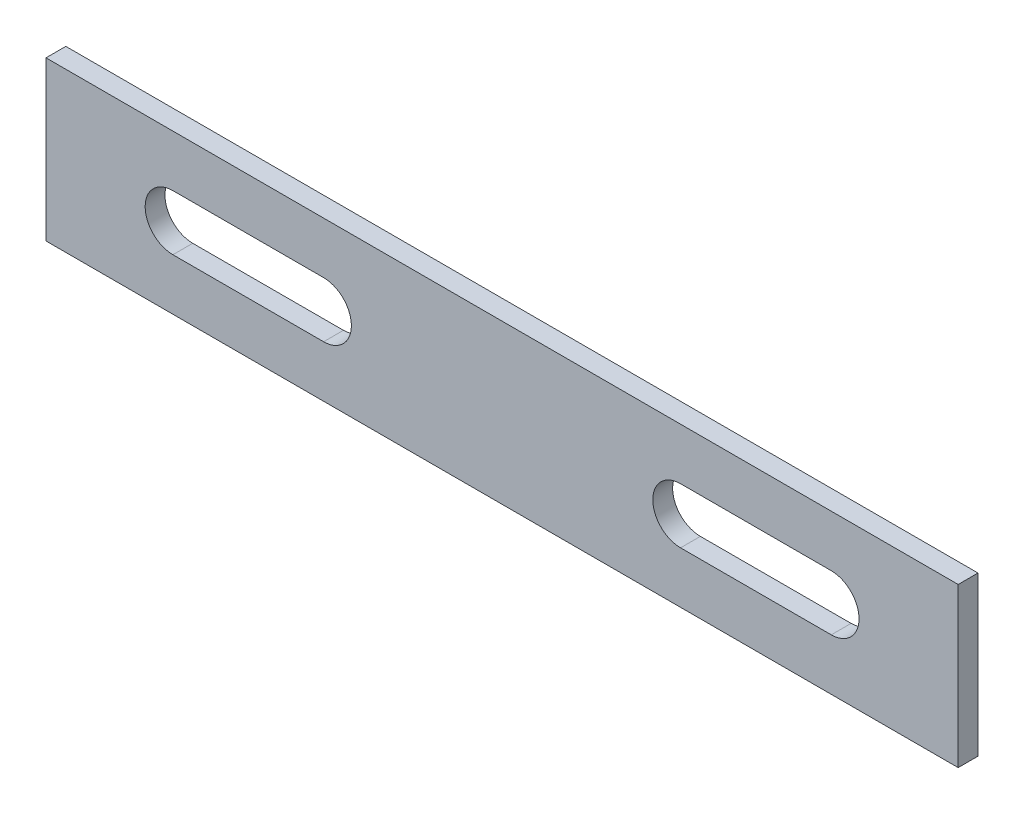
ISO-10303-21;
HEADER;
FILE_DESCRIPTION(('STEP AP214'),'2;1');
FILE_NAME('part.step','',(''),(''),'','','');
FILE_SCHEMA(('AUTOMOTIVE_DESIGN { 1 0 10303 214 1 1 1 1 }'));
ENDSEC;
DATA;
#1=APPLICATION_CONTEXT('core data for automotive mechanical design processes');
#2=APPLICATION_PROTOCOL_DEFINITION('international standard','automotive_design',2000,#1);
#3=PRODUCT_CONTEXT('',#1,'mechanical');
#4=PRODUCT('Part','Part','',(#3));
#5=PRODUCT_RELATED_PRODUCT_CATEGORY('part','',(#4));
#6=PRODUCT_DEFINITION_FORMATION('','',#4);
#7=PRODUCT_DEFINITION_CONTEXT('part definition',#1,'design');
#8=PRODUCT_DEFINITION('design','',#6,#7);
#9=PRODUCT_DEFINITION_SHAPE('','',#8);
#10=(LENGTH_UNIT() NAMED_UNIT(*) SI_UNIT(.MILLI.,.METRE.));
#11=(NAMED_UNIT(*) PLANE_ANGLE_UNIT() SI_UNIT($,.RADIAN.));
#12=(NAMED_UNIT(*) SI_UNIT($,.STERADIAN.) SOLID_ANGLE_UNIT());
#13=UNCERTAINTY_MEASURE_WITH_UNIT(LENGTH_MEASURE(1.E-05),#10,'distance_accuracy_value','');
#14=(GEOMETRIC_REPRESENTATION_CONTEXT(3) GLOBAL_UNCERTAINTY_ASSIGNED_CONTEXT((#13)) GLOBAL_UNIT_ASSIGNED_CONTEXT((#10,
#11,#12)) REPRESENTATION_CONTEXT('',''));
#15=CARTESIAN_POINT('',(0.,0.,0.));
#16=DIRECTION('',(0.,0.,1.));
#17=DIRECTION('',(1.,0.,0.));
#18=AXIS2_PLACEMENT_3D('',#15,#16,#17);
#19=CARTESIAN_POINT('',(115.000000000001,-19.9999999999998,2.50000000000006));
#20=DIRECTION('',(0.,1.00000000000002,0.));
#21=DIRECTION('',(0.,0.,0.999999999999993));
#22=AXIS2_PLACEMENT_3D('',#19,#20,#21);
#23=PLANE('',#22);
#24=DIRECTION('',(0.,0.,-0.999999999999993));
#25=VECTOR('',#24,1.);
#26=CARTESIAN_POINT('',(-115.,-20.0000000000004,2.50000000000017));
#27=LINE('',#26,#25);
#28=CARTESIAN_POINT('',(-115.,-20.0000000000004,2.50000000000017));
#29=VERTEX_POINT('',#28);
#30=CARTESIAN_POINT('',(-115.,-20.0000000000007,-2.4999999999995));
#31=VERTEX_POINT('',#30);
#32=EDGE_CURVE('E235',#29,#31,#27,.T.);
#33=ORIENTED_EDGE('',*,*,#32,.T.);
#34=DIRECTION('',(-1.,0.,0.));
#35=VECTOR('',#34,1.);
#36=CARTESIAN_POINT('',(115.000000000002,-20.0000000000001,-2.49999999999972));
#37=LINE('',#36,#35);
#38=CARTESIAN_POINT('',(115.000000000002,-20.0000000000001,-2.49999999999972));
#39=VERTEX_POINT('',#38);
#40=EDGE_CURVE('E13',#39,#31,#37,.T.);
#41=ORIENTED_EDGE('',*,*,#40,.F.);
#42=DIRECTION('',(0.,0.,-0.999999999999993));
#43=VECTOR('',#42,1.);
#44=CARTESIAN_POINT('',(115.000000000001,-19.9999999999998,2.50000000000006));
#45=LINE('',#44,#43);
#46=CARTESIAN_POINT('',(115.000000000001,-19.9999999999998,2.50000000000006));
#47=VERTEX_POINT('',#46);
#48=EDGE_CURVE('E209',#47,#39,#45,.T.);
#49=ORIENTED_EDGE('',*,*,#48,.F.);
#50=DIRECTION('',(-1.,0.,0.));
#51=VECTOR('',#50,1.);
#52=CARTESIAN_POINT('',(115.000000000001,-19.9999999999998,2.50000000000006));
#53=LINE('',#52,#51);
#54=EDGE_CURVE('E212',#47,#29,#53,.T.);
#55=ORIENTED_EDGE('',*,*,#54,.T.);
#56=EDGE_LOOP('',(#33,#41,#49,#55));
#57=FACE_BOUND('',#56,.T.);
#58=ADVANCED_FACE('F58',(#57),#23,.F.);
#59=CARTESIAN_POINT('',(115.000000000002,-20.0000000000001,-2.49999999999972));
#60=DIRECTION('',(0.,0.,0.999999999999994));
#61=DIRECTION('',(1.,0.,0.));
#62=AXIS2_PLACEMENT_3D('',#59,#60,#61);
#63=PLANE('',#62);
#64=DIRECTION('',(1.,0.,0.));
#65=VECTOR('',#64,1.);
#66=CARTESIAN_POINT('',(83.0000000000007,-7.00000000000017,-2.49999999999961));
#67=LINE('',#66,#65);
#68=CARTESIAN_POINT('',(45.0000000000007,-7.00000000000012,-2.4999999999995));
#69=VERTEX_POINT('',#68);
#70=CARTESIAN_POINT('',(83.0000000000007,-7.00000000000017,-2.49999999999961));
#71=VERTEX_POINT('',#70);
#72=EDGE_CURVE('E285',#69,#71,#67,.T.);
#73=ORIENTED_EDGE('',*,*,#72,.T.);
#74=CARTESIAN_POINT('',(83.0000000000003,9.99200722162641E-13,-2.4999999999995));
#75=DIRECTION('',(0.,0.,0.999999999999993));
#76=DIRECTION('',(-1.,0.,0.));
#77=AXIS2_PLACEMENT_3D('',#74,#75,#76);
#78=CIRCLE('',#77,7.);
#79=CARTESIAN_POINT('',(82.9999999999997,7.00000000000028,-2.4999999999995));
#80=VERTEX_POINT('',#79);
#81=EDGE_CURVE('E170',#71,#80,#78,.T.);
#82=ORIENTED_EDGE('',*,*,#81,.T.);
#83=DIRECTION('',(-1.,0.,0.));
#84=VECTOR('',#83,1.);
#85=CARTESIAN_POINT('',(82.9999999999997,7.00000000000028,-2.4999999999995));
#86=LINE('',#85,#84);
#87=CARTESIAN_POINT('',(45.0000000000005,7.00000000000001,-2.4999999999995));
#88=VERTEX_POINT('',#87);
#89=EDGE_CURVE('E291',#80,#88,#86,.T.);
#90=ORIENTED_EDGE('',*,*,#89,.T.);
#91=CARTESIAN_POINT('',(45.0000000000008,-4.9960036108132E-13,-2.49999999999995));
#92=DIRECTION('',(0.,0.,0.999999999999993));
#93=DIRECTION('',(-1.,0.,0.));
#94=AXIS2_PLACEMENT_3D('',#91,#92,#93);
#95=CIRCLE('',#94,7.);
#96=EDGE_CURVE('E72',#88,#69,#95,.T.);
#97=ORIENTED_EDGE('',*,*,#96,.T.);
#98=EDGE_LOOP('',(#73,#82,#90,#97));
#99=FACE_BOUND('',#98,.T.);
#100=DIRECTION('',(-1.,0.,0.));
#101=VECTOR('',#100,1.);
#102=CARTESIAN_POINT('',(-82.9999999999999,6.99999999999978,-2.49999999999984));
#103=LINE('',#102,#101);
#104=CARTESIAN_POINT('',(-44.9999999999998,6.99999999999945,-2.49999999999961));
#105=VERTEX_POINT('',#104);
#106=CARTESIAN_POINT('',(-82.9999999999999,6.99999999999978,-2.49999999999984));
#107=VERTEX_POINT('',#106);
#108=EDGE_CURVE('E252',#105,#107,#103,.T.);
#109=ORIENTED_EDGE('',*,*,#108,.T.);
#110=CARTESIAN_POINT('',(-82.9999999999993,-1.11022302462516E-13,-2.49999999999928));
#111=DIRECTION('',(0.,0.,0.999999999999993));
#112=DIRECTION('',(1.,0.,0.));
#113=AXIS2_PLACEMENT_3D('',#110,#111,#112);
#114=CIRCLE('',#113,7.);
#115=CARTESIAN_POINT('',(-82.9999999999987,-7.00000000000139,-2.49999999999928));
#116=VERTEX_POINT('',#115);
#117=EDGE_CURVE('E264',#107,#116,#114,.T.);
#118=ORIENTED_EDGE('',*,*,#117,.T.);
#119=DIRECTION('',(1.,0.,0.));
#120=VECTOR('',#119,1.);
#121=CARTESIAN_POINT('',(-82.9999999999987,-7.00000000000139,-2.49999999999928));
#122=LINE('',#121,#120);
#123=CARTESIAN_POINT('',(-44.9999999999996,-7.00000000000028,-2.49999999999972));
#124=VERTEX_POINT('',#123);
#125=EDGE_CURVE('E262',#116,#124,#122,.T.);
#126=ORIENTED_EDGE('',*,*,#125,.T.);
#127=CARTESIAN_POINT('',(-44.999999999999,1.11022302462516E-13,-2.49999999999961));
#128=DIRECTION('',(0.,0.,0.999999999999993));
#129=DIRECTION('',(1.,0.,0.));
#130=AXIS2_PLACEMENT_3D('',#127,#128,#129);
#131=CIRCLE('',#130,7.);
#132=EDGE_CURVE('E259',#124,#105,#131,.T.);
#133=ORIENTED_EDGE('',*,*,#132,.T.);
#134=EDGE_LOOP('',(#109,#118,#126,#133));
#135=FACE_BOUND('',#134,.T.);
#136=DIRECTION('',(0.,1.00000000000002,0.));
#137=VECTOR('',#136,1.);
#138=CARTESIAN_POINT('',(-115.,-20.0000000000007,-2.4999999999995));
#139=LINE('',#138,#137);
#140=CARTESIAN_POINT('',(-115.000000000001,19.9999999999991,-2.4999999999995));
#141=VERTEX_POINT('',#140);
#142=EDGE_CURVE('E234',#31,#141,#139,.T.);
#143=ORIENTED_EDGE('',*,*,#142,.T.);
#144=DIRECTION('',(-1.,0.,0.));
#145=VECTOR('',#144,1.);
#146=CARTESIAN_POINT('',(115.000000000001,20.0000000000002,-2.49999999999939));
#147=LINE('',#146,#145);
#148=CARTESIAN_POINT('',(115.000000000001,20.0000000000002,-2.49999999999939));
#149=VERTEX_POINT('',#148);
#150=EDGE_CURVE('E65',#149,#141,#147,.T.);
#151=ORIENTED_EDGE('',*,*,#150,.F.);
#152=DIRECTION('',(0.,1.00000000000002,0.));
#153=VECTOR('',#152,1.);
#154=CARTESIAN_POINT('',(115.000000000002,-20.0000000000001,-2.49999999999972));
#155=LINE('',#154,#153);
#156=EDGE_CURVE('E244',#39,#149,#155,.T.);
#157=ORIENTED_EDGE('',*,*,#156,.F.);
#158=ORIENTED_EDGE('',*,*,#40,.T.);
#159=EDGE_LOOP('',(#143,#151,#157,#158));
#160=FACE_BOUND('',#159,.T.);
#161=ADVANCED_FACE('F293',(#99,#135,#160),#63,.F.);
#162=CARTESIAN_POINT('',(115.,19.9999999999999,2.50000000000017));
#163=DIRECTION('',(0.,-1.00000000000002,0.));
#164=DIRECTION('',(0.,0.,-0.999999999999993));
#165=AXIS2_PLACEMENT_3D('',#162,#163,#164);
#166=PLANE('',#165);
#167=DIRECTION('',(0.,0.,0.999999999999993));
#168=VECTOR('',#167,1.);
#169=CARTESIAN_POINT('',(-115.,19.9999999999994,2.50000000000083));
#170=LINE('',#169,#168);
#171=CARTESIAN_POINT('',(-115.,19.9999999999994,2.50000000000083));
#172=VERTEX_POINT('',#171);
#173=EDGE_CURVE('E210',#141,#172,#170,.T.);
#174=ORIENTED_EDGE('',*,*,#173,.T.);
#175=DIRECTION('',(-1.,0.,0.));
#176=VECTOR('',#175,1.);
#177=CARTESIAN_POINT('',(115.,19.9999999999999,2.50000000000017));
#178=LINE('',#177,#176);
#179=CARTESIAN_POINT('',(115.,19.9999999999999,2.50000000000017));
#180=VERTEX_POINT('',#179);
#181=EDGE_CURVE('E216',#180,#172,#178,.T.);
#182=ORIENTED_EDGE('',*,*,#181,.F.);
#183=DIRECTION('',(0.,0.,0.999999999999993));
#184=VECTOR('',#183,1.);
#185=CARTESIAN_POINT('',(115.,19.9999999999999,2.50000000000017));
#186=LINE('',#185,#184);
#187=EDGE_CURVE('E228',#149,#180,#186,.T.);
#188=ORIENTED_EDGE('',*,*,#187,.F.);
#189=ORIENTED_EDGE('',*,*,#150,.T.);
#190=EDGE_LOOP('',(#174,#182,#188,#189));
#191=FACE_BOUND('',#190,.T.);
#192=ADVANCED_FACE('F226',(#191),#166,.F.);
#193=CARTESIAN_POINT('',(115.000000000001,-19.9999999999998,2.50000000000006));
#194=DIRECTION('',(0.,0.,-0.999999999999994));
#195=DIRECTION('',(-1.,0.,0.));
#196=AXIS2_PLACEMENT_3D('',#193,#194,#195);
#197=PLANE('',#196);
#198=DIRECTION('',(-1.,0.,0.));
#199=VECTOR('',#198,1.);
#200=CARTESIAN_POINT('',(83.,7.00000000000012,2.50000000000017));
#201=LINE('',#200,#199);
#202=CARTESIAN_POINT('',(83.,7.00000000000012,2.50000000000017));
#203=VERTEX_POINT('',#202);
#204=CARTESIAN_POINT('',(45.0000000000002,6.99999999999984,2.50000000000017));
#205=VERTEX_POINT('',#204);
#206=EDGE_CURVE('E157',#203,#205,#201,.T.);
#207=ORIENTED_EDGE('',*,*,#206,.F.);
#208=CARTESIAN_POINT('',(83.0000000000004,8.88178419700125E-13,2.50000000000039));
#209=DIRECTION('',(0.,0.,0.999999999999993));
#210=DIRECTION('',(-1.,0.,0.));
#211=AXIS2_PLACEMENT_3D('',#208,#209,#210);
#212=CIRCLE('',#211,7.);
#213=CARTESIAN_POINT('',(83.0000000000007,-7.00000000000012,2.50000000000061));
#214=VERTEX_POINT('',#213);
#215=EDGE_CURVE('E80',#214,#203,#212,.T.);
#216=ORIENTED_EDGE('',*,*,#215,.F.);
#217=DIRECTION('',(1.,0.,0.));
#218=VECTOR('',#217,1.);
#219=CARTESIAN_POINT('',(83.0000000000007,-7.00000000000012,2.50000000000061));
#220=LINE('',#219,#218);
#221=CARTESIAN_POINT('',(45.0000000000004,-7.00000000000012,2.50000000000017));
#222=VERTEX_POINT('',#221);
#223=EDGE_CURVE('E165',#222,#214,#220,.T.);
#224=ORIENTED_EDGE('',*,*,#223,.F.);
#225=CARTESIAN_POINT('',(45.0000000000002,-5.55111512312578E-13,2.49999999999995));
#226=DIRECTION('',(0.,0.,0.999999999999993));
#227=DIRECTION('',(-1.,0.,0.));
#228=AXIS2_PLACEMENT_3D('',#225,#226,#227);
#229=CIRCLE('',#228,7.);
#230=EDGE_CURVE('E148',#205,#222,#229,.T.);
#231=ORIENTED_EDGE('',*,*,#230,.F.);
#232=EDGE_LOOP('',(#207,#216,#224,#231));
#233=FACE_BOUND('',#232,.T.);
#234=DIRECTION('',(1.,0.,0.));
#235=VECTOR('',#234,1.);
#236=CARTESIAN_POINT('',(-82.9999999999989,-7.0000000000015,2.50000000000006));
#237=LINE('',#236,#235);
#238=CARTESIAN_POINT('',(-82.9999999999989,-7.0000000000015,2.50000000000006));
#239=VERTEX_POINT('',#238);
#240=CARTESIAN_POINT('',(-44.9999999999995,-7.00000000000051,2.50000000000017));
#241=VERTEX_POINT('',#240);
#242=EDGE_CURVE('E185',#239,#241,#237,.T.);
#243=ORIENTED_EDGE('',*,*,#242,.F.);
#244=CARTESIAN_POINT('',(-82.9999999999996,0.,2.50000000000028));
#245=DIRECTION('',(0.,0.,0.999999999999993));
#246=DIRECTION('',(1.,0.,0.));
#247=AXIS2_PLACEMENT_3D('',#244,#245,#246);
#248=CIRCLE('',#247,7.);
#249=CARTESIAN_POINT('',(-82.9999999999992,6.99999999999984,2.50000000000017));
#250=VERTEX_POINT('',#249);
#251=EDGE_CURVE('E190',#250,#239,#248,.T.);
#252=ORIENTED_EDGE('',*,*,#251,.F.);
#253=DIRECTION('',(-1.,0.,0.));
#254=VECTOR('',#253,1.);
#255=CARTESIAN_POINT('',(-82.9999999999992,6.99999999999984,2.50000000000017));
#256=LINE('',#255,#254);
#257=CARTESIAN_POINT('',(-44.9999999999994,6.99999999999945,2.5000000000005));
#258=VERTEX_POINT('',#257);
#259=EDGE_CURVE('E197',#258,#250,#256,.T.);
#260=ORIENTED_EDGE('',*,*,#259,.F.);
#261=CARTESIAN_POINT('',(-44.9999999999997,-3.88578058618805E-13,2.50000000000039));
#262=DIRECTION('',(0.,0.,0.999999999999993));
#263=DIRECTION('',(1.,0.,0.));
#264=AXIS2_PLACEMENT_3D('',#261,#262,#263);
#265=CIRCLE('',#264,7.);
#266=EDGE_CURVE('E189',#241,#258,#265,.T.);
#267=ORIENTED_EDGE('',*,*,#266,.F.);
#268=EDGE_LOOP('',(#243,#252,#260,#267));
#269=FACE_BOUND('',#268,.T.);
#270=DIRECTION('',(0.,-1.00000000000002,0.));
#271=VECTOR('',#270,1.);
#272=CARTESIAN_POINT('',(-115.,-20.0000000000004,2.50000000000017));
#273=LINE('',#272,#271);
#274=EDGE_CURVE('E205',#172,#29,#273,.T.);
#275=ORIENTED_EDGE('',*,*,#274,.T.);
#276=ORIENTED_EDGE('',*,*,#54,.F.);
#277=DIRECTION('',(0.,-1.00000000000002,0.));
#278=VECTOR('',#277,1.);
#279=CARTESIAN_POINT('',(115.000000000001,-19.9999999999998,2.50000000000006));
#280=LINE('',#279,#278);
#281=EDGE_CURVE('E217',#180,#47,#280,.T.);
#282=ORIENTED_EDGE('',*,*,#281,.F.);
#283=ORIENTED_EDGE('',*,*,#181,.T.);
#284=EDGE_LOOP('',(#275,#276,#282,#283));
#285=FACE_BOUND('',#284,.T.);
#286=ADVANCED_FACE('F162',(#233,#269,#285),#197,.F.);
#287=CARTESIAN_POINT('',(115.000000000002,-20.0000000000001,-2.49999999999972));
#288=DIRECTION('',(1.,0.,0.));
#289=DIRECTION('',(0.,0.,-0.999999999999993));
#290=AXIS2_PLACEMENT_3D('',#287,#288,#289);
#291=PLANE('',#290);
#292=ORIENTED_EDGE('',*,*,#48,.T.);
#293=ORIENTED_EDGE('',*,*,#156,.T.);
#294=ORIENTED_EDGE('',*,*,#187,.T.);
#295=ORIENTED_EDGE('',*,*,#281,.T.);
#296=EDGE_LOOP('',(#292,#293,#294,#295));
#297=FACE_BOUND('',#296,.T.);
#298=ADVANCED_FACE('F320',(#297),#291,.T.);
#299=CARTESIAN_POINT('',(-115.,-20.0000000000007,-2.4999999999995));
#300=DIRECTION('',(1.,0.,0.));
#301=DIRECTION('',(0.,0.,-0.999999999999993));
#302=AXIS2_PLACEMENT_3D('',#299,#300,#301);
#303=PLANE('',#302);
#304=ORIENTED_EDGE('',*,*,#32,.F.);
#305=ORIENTED_EDGE('',*,*,#274,.F.);
#306=ORIENTED_EDGE('',*,*,#173,.F.);
#307=ORIENTED_EDGE('',*,*,#142,.F.);
#308=EDGE_LOOP('',(#304,#305,#306,#307));
#309=FACE_BOUND('',#308,.T.);
#310=ADVANCED_FACE('F233',(#309),#303,.F.);
#311=CARTESIAN_POINT('',(-82.9999999999993,-1.11022302462516E-13,-2.49999999999928));
#312=DIRECTION('',(0.,0.,0.999999999999993));
#313=DIRECTION('',(1.,0.,0.));
#314=AXIS2_PLACEMENT_3D('',#311,#312,#313);
#315=CYLINDRICAL_SURFACE('',#314,7.);
#316=DIRECTION('',(0.,0.,0.999999999999993));
#317=VECTOR('',#316,1.);
#318=CARTESIAN_POINT('',(-82.9999999999987,-7.00000000000139,-2.49999999999928));
#319=LINE('',#318,#317);
#320=EDGE_CURVE('E248',#116,#239,#319,.T.);
#321=ORIENTED_EDGE('',*,*,#320,.F.);
#322=ORIENTED_EDGE('',*,*,#117,.F.);
#323=DIRECTION('',(0.,0.,0.999999999999993));
#324=VECTOR('',#323,1.);
#325=CARTESIAN_POINT('',(-82.9999999999999,6.99999999999978,-2.49999999999984));
#326=LINE('',#325,#324);
#327=EDGE_CURVE('E237',#107,#250,#326,.T.);
#328=ORIENTED_EDGE('',*,*,#327,.T.);
#329=ORIENTED_EDGE('',*,*,#251,.T.);
#330=EDGE_LOOP('',(#321,#322,#328,#329));
#331=FACE_BOUND('',#330,.T.);
#332=ADVANCED_FACE('F327',(#331),#315,.F.);
#333=CARTESIAN_POINT('',(-82.9999999999999,6.99999999999978,-2.49999999999984));
#334=DIRECTION('',(0.,1.00000000000002,0.));
#335=DIRECTION('',(0.,0.,0.999999999999993));
#336=AXIS2_PLACEMENT_3D('',#333,#334,#335);
#337=PLANE('',#336);
#338=ORIENTED_EDGE('',*,*,#327,.F.);
#339=ORIENTED_EDGE('',*,*,#108,.F.);
#340=DIRECTION('',(0.,0.,0.999999999999993));
#341=VECTOR('',#340,1.);
#342=CARTESIAN_POINT('',(-44.9999999999998,6.99999999999945,-2.49999999999961));
#343=LINE('',#342,#341);
#344=EDGE_CURVE('E254',#105,#258,#343,.T.);
#345=ORIENTED_EDGE('',*,*,#344,.T.);
#346=ORIENTED_EDGE('',*,*,#259,.T.);
#347=EDGE_LOOP('',(#338,#339,#345,#346));
#348=FACE_BOUND('',#347,.T.);
#349=ADVANCED_FACE('F274',(#348),#337,.F.);
#350=CARTESIAN_POINT('',(-44.999999999999,1.11022302462516E-13,-2.49999999999961));
#351=DIRECTION('',(0.,0.,0.999999999999993));
#352=DIRECTION('',(1.,0.,0.));
#353=AXIS2_PLACEMENT_3D('',#350,#351,#352);
#354=CYLINDRICAL_SURFACE('',#353,7.);
#355=ORIENTED_EDGE('',*,*,#344,.F.);
#356=ORIENTED_EDGE('',*,*,#132,.F.);
#357=DIRECTION('',(0.,0.,0.999999999999993));
#358=VECTOR('',#357,1.);
#359=CARTESIAN_POINT('',(-44.9999999999996,-7.00000000000028,-2.49999999999972));
#360=LINE('',#359,#358);
#361=EDGE_CURVE('E251',#124,#241,#360,.T.);
#362=ORIENTED_EDGE('',*,*,#361,.T.);
#363=ORIENTED_EDGE('',*,*,#266,.T.);
#364=EDGE_LOOP('',(#355,#356,#362,#363));
#365=FACE_BOUND('',#364,.T.);
#366=ADVANCED_FACE('F305',(#365),#354,.F.);
#367=CARTESIAN_POINT('',(-82.9999999999987,-7.00000000000139,-2.49999999999928));
#368=DIRECTION('',(0.,-1.00000000000002,0.));
#369=DIRECTION('',(0.,0.,-0.999999999999993));
#370=AXIS2_PLACEMENT_3D('',#367,#368,#369);
#371=PLANE('',#370);
#372=ORIENTED_EDGE('',*,*,#361,.F.);
#373=ORIENTED_EDGE('',*,*,#125,.F.);
#374=ORIENTED_EDGE('',*,*,#320,.T.);
#375=ORIENTED_EDGE('',*,*,#242,.T.);
#376=EDGE_LOOP('',(#372,#373,#374,#375));
#377=FACE_BOUND('',#376,.T.);
#378=ADVANCED_FACE('F297',(#377),#371,.F.);
#379=CARTESIAN_POINT('',(83.0000000000003,9.99200722162641E-13,-2.4999999999995));
#380=DIRECTION('',(0.,0.,0.999999999999993));
#381=DIRECTION('',(1.,0.,0.));
#382=AXIS2_PLACEMENT_3D('',#379,#380,#381);
#383=CYLINDRICAL_SURFACE('',#382,7.);
#384=DIRECTION('',(0.,0.,0.999999999999993));
#385=VECTOR('',#384,1.);
#386=CARTESIAN_POINT('',(82.9999999999997,7.00000000000028,-2.4999999999995));
#387=LINE('',#386,#385);
#388=EDGE_CURVE('E154',#80,#203,#387,.T.);
#389=ORIENTED_EDGE('',*,*,#388,.F.);
#390=ORIENTED_EDGE('',*,*,#81,.F.);
#391=DIRECTION('',(0.,0.,0.999999999999993));
#392=VECTOR('',#391,1.);
#393=CARTESIAN_POINT('',(83.0000000000007,-7.00000000000017,-2.49999999999961));
#394=LINE('',#393,#392);
#395=EDGE_CURVE('E280',#71,#214,#394,.T.);
#396=ORIENTED_EDGE('',*,*,#395,.T.);
#397=ORIENTED_EDGE('',*,*,#215,.T.);
#398=EDGE_LOOP('',(#389,#390,#396,#397));
#399=FACE_BOUND('',#398,.T.);
#400=ADVANCED_FACE('F294',(#399),#383,.F.);
#401=CARTESIAN_POINT('',(83.0000000000007,-7.00000000000017,-2.49999999999961));
#402=DIRECTION('',(0.,-1.00000000000002,0.));
#403=DIRECTION('',(1.,0.,0.));
#404=AXIS2_PLACEMENT_3D('',#401,#402,#403);
#405=PLANE('',#404);
#406=ORIENTED_EDGE('',*,*,#395,.F.);
#407=ORIENTED_EDGE('',*,*,#72,.F.);
#408=DIRECTION('',(0.,0.,0.999999999999993));
#409=VECTOR('',#408,1.);
#410=CARTESIAN_POINT('',(45.0000000000007,-7.00000000000012,-2.4999999999995));
#411=LINE('',#410,#409);
#412=EDGE_CURVE('E153',#69,#222,#411,.T.);
#413=ORIENTED_EDGE('',*,*,#412,.T.);
#414=ORIENTED_EDGE('',*,*,#223,.T.);
#415=EDGE_LOOP('',(#406,#407,#413,#414));
#416=FACE_BOUND('',#415,.T.);
#417=ADVANCED_FACE('F296',(#416),#405,.F.);
#418=CARTESIAN_POINT('',(45.0000000000008,-4.9960036108132E-13,-2.49999999999995));
#419=DIRECTION('',(0.,0.,0.999999999999993));
#420=DIRECTION('',(1.,0.,0.));
#421=AXIS2_PLACEMENT_3D('',#418,#419,#420);
#422=CYLINDRICAL_SURFACE('',#421,7.);
#423=ORIENTED_EDGE('',*,*,#412,.F.);
#424=ORIENTED_EDGE('',*,*,#96,.F.);
#425=DIRECTION('',(0.,0.,0.999999999999993));
#426=VECTOR('',#425,1.);
#427=CARTESIAN_POINT('',(45.0000000000005,7.00000000000001,-2.4999999999995));
#428=LINE('',#427,#426);
#429=EDGE_CURVE('E144',#88,#205,#428,.T.);
#430=ORIENTED_EDGE('',*,*,#429,.T.);
#431=ORIENTED_EDGE('',*,*,#230,.T.);
#432=EDGE_LOOP('',(#423,#424,#430,#431));
#433=FACE_BOUND('',#432,.T.);
#434=ADVANCED_FACE('F146',(#433),#422,.F.);
#435=CARTESIAN_POINT('',(82.9999999999997,7.00000000000028,-2.4999999999995));
#436=DIRECTION('',(0.,1.00000000000002,0.));
#437=DIRECTION('',(-1.,0.,0.));
#438=AXIS2_PLACEMENT_3D('',#435,#436,#437);
#439=PLANE('',#438);
#440=ORIENTED_EDGE('',*,*,#429,.F.);
#441=ORIENTED_EDGE('',*,*,#89,.F.);
#442=ORIENTED_EDGE('',*,*,#388,.T.);
#443=ORIENTED_EDGE('',*,*,#206,.T.);
#444=EDGE_LOOP('',(#440,#441,#442,#443));
#445=FACE_BOUND('',#444,.T.);
#446=ADVANCED_FACE('F158',(#445),#439,.F.);
#447=CLOSED_SHELL('',(#58,#161,#192,#286,#298,#310,#332,#349,#366,#378,#400,#417,#434,#446));
#448=MANIFOLD_SOLID_BREP('B2',#447);
#449=ADVANCED_BREP_SHAPE_REPRESENTATION('',(#18,#448),#14);
#450=SHAPE_DEFINITION_REPRESENTATION(#9,#449);
ENDSEC;
END-ISO-10303-21;
